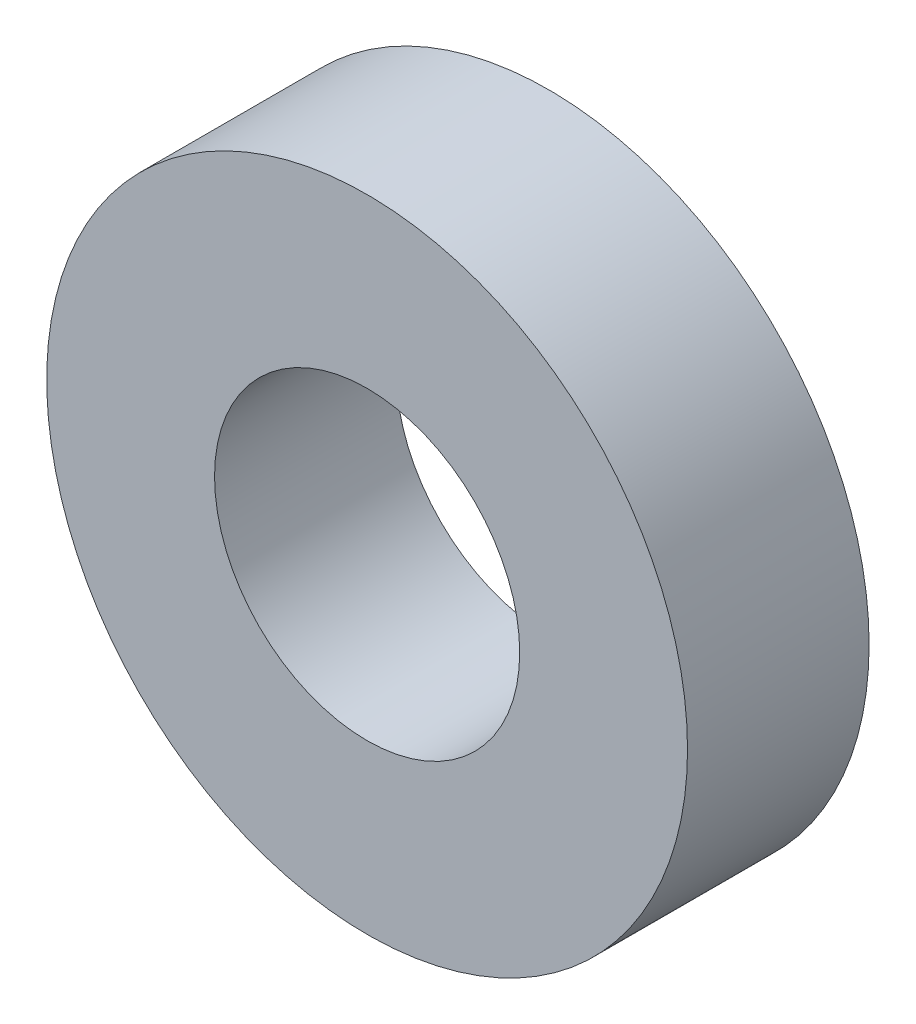
ISO-10303-21;
HEADER;
FILE_DESCRIPTION(('STEP AP214'),'2;1');
FILE_NAME('part.step','',(''),(''),'','','');
FILE_SCHEMA(('AUTOMOTIVE_DESIGN { 1 0 10303 214 1 1 1 1 }'));
ENDSEC;
DATA;
#1=APPLICATION_CONTEXT('core data for automotive mechanical design processes');
#2=APPLICATION_PROTOCOL_DEFINITION('international standard','automotive_design',2000,#1);
#3=PRODUCT_CONTEXT('',#1,'mechanical');
#4=PRODUCT('Part','Part','',(#3));
#5=PRODUCT_RELATED_PRODUCT_CATEGORY('part','',(#4));
#6=PRODUCT_DEFINITION_FORMATION('','',#4);
#7=PRODUCT_DEFINITION_CONTEXT('part definition',#1,'design');
#8=PRODUCT_DEFINITION('design','',#6,#7);
#9=PRODUCT_DEFINITION_SHAPE('','',#8);
#10=(LENGTH_UNIT() NAMED_UNIT(*) SI_UNIT(.MILLI.,.METRE.));
#11=(NAMED_UNIT(*) PLANE_ANGLE_UNIT() SI_UNIT($,.RADIAN.));
#12=(NAMED_UNIT(*) SI_UNIT($,.STERADIAN.) SOLID_ANGLE_UNIT());
#13=UNCERTAINTY_MEASURE_WITH_UNIT(LENGTH_MEASURE(1.E-05),#10,'distance_accuracy_value','');
#14=(GEOMETRIC_REPRESENTATION_CONTEXT(3) GLOBAL_UNCERTAINTY_ASSIGNED_CONTEXT((#13)) GLOBAL_UNIT_ASSIGNED_CONTEXT((#10,
#11,#12)) REPRESENTATION_CONTEXT('',''));
#15=CARTESIAN_POINT('',(0.,0.,0.));
#16=DIRECTION('',(0.,0.,1.));
#17=DIRECTION('',(1.,0.,0.));
#18=AXIS2_PLACEMENT_3D('',#15,#16,#17);
#19=CARTESIAN_POINT('',(0.,0.,11.9));
#20=DIRECTION('',(0.,0.,1.));
#21=DIRECTION('',(1.,0.,0.));
#22=AXIS2_PLACEMENT_3D('',#19,#20,#21);
#23=PLANE('',#22);
#24=CARTESIAN_POINT('',(0.,0.,11.9));
#25=DIRECTION('',(0.,0.,1.));
#26=DIRECTION('',(1.,0.,0.));
#27=AXIS2_PLACEMENT_3D('',#24,#25,#26);
#28=CIRCLE('',#27,21.);
#29=CARTESIAN_POINT('',(21.,0.,11.9));
#30=VERTEX_POINT('',#29);
#31=EDGE_CURVE('E10',#30,#30,#28,.T.);
#32=ORIENTED_EDGE('',*,*,#31,.T.);
#33=EDGE_LOOP('',(#32));
#34=FACE_BOUND('',#33,.T.);
#35=CARTESIAN_POINT('',(0.,0.,11.9));
#36=DIRECTION('',(0.,0.,1.));
#37=DIRECTION('',(1.,0.,0.));
#38=AXIS2_PLACEMENT_3D('',#35,#36,#37);
#39=CIRCLE('',#38,10.);
#40=CARTESIAN_POINT('',(10.,0.,11.9));
#41=VERTEX_POINT('',#40);
#42=EDGE_CURVE('E42',#41,#41,#39,.T.);
#43=ORIENTED_EDGE('',*,*,#42,.F.);
#44=EDGE_LOOP('',(#43));
#45=FACE_BOUND('',#44,.T.);
#46=ADVANCED_FACE('F31',(#34,#45),#23,.T.);
#47=CARTESIAN_POINT('',(0.,0.,0.));
#48=DIRECTION('',(0.,0.,1.));
#49=DIRECTION('',(1.,0.,0.));
#50=AXIS2_PLACEMENT_3D('',#47,#48,#49);
#51=PLANE('',#50);
#52=CARTESIAN_POINT('',(0.,0.,0.));
#53=DIRECTION('',(0.,0.,1.));
#54=DIRECTION('',(1.,0.,0.));
#55=AXIS2_PLACEMENT_3D('',#52,#53,#54);
#56=CIRCLE('',#55,21.);
#57=CARTESIAN_POINT('',(21.,0.,0.));
#58=VERTEX_POINT('',#57);
#59=EDGE_CURVE('E35',#58,#58,#56,.T.);
#60=ORIENTED_EDGE('',*,*,#59,.F.);
#61=EDGE_LOOP('',(#60));
#62=FACE_BOUND('',#61,.T.);
#63=CARTESIAN_POINT('',(0.,0.,0.));
#64=DIRECTION('',(0.,0.,1.));
#65=DIRECTION('',(1.,0.,0.));
#66=AXIS2_PLACEMENT_3D('',#63,#64,#65);
#67=CIRCLE('',#66,10.);
#68=CARTESIAN_POINT('',(10.,0.,0.));
#69=VERTEX_POINT('',#68);
#70=EDGE_CURVE('E44',#69,#69,#67,.T.);
#71=ORIENTED_EDGE('',*,*,#70,.T.);
#72=EDGE_LOOP('',(#71));
#73=FACE_BOUND('',#72,.T.);
#74=ADVANCED_FACE('F54',(#62,#73),#51,.F.);
#75=CARTESIAN_POINT('',(0.,0.,11.9));
#76=DIRECTION('',(0.,0.,-1.));
#77=DIRECTION('',(-1.,0.,0.));
#78=AXIS2_PLACEMENT_3D('',#75,#76,#77);
#79=CYLINDRICAL_SURFACE('',#78,21.);
#80=ORIENTED_EDGE('',*,*,#31,.F.);
#81=EDGE_LOOP('',(#80));
#82=FACE_BOUND('',#81,.T.);
#83=ORIENTED_EDGE('',*,*,#59,.T.);
#84=EDGE_LOOP('',(#83));
#85=FACE_BOUND('',#84,.T.);
#86=ADVANCED_FACE('F33',(#82,#85),#79,.T.);
#87=CARTESIAN_POINT('',(0.,0.,11.9));
#88=DIRECTION('',(0.,0.,-1.));
#89=DIRECTION('',(-1.,0.,0.));
#90=AXIS2_PLACEMENT_3D('',#87,#88,#89);
#91=CYLINDRICAL_SURFACE('',#90,10.);
#92=ORIENTED_EDGE('',*,*,#42,.T.);
#93=EDGE_LOOP('',(#92));
#94=FACE_BOUND('',#93,.T.);
#95=ORIENTED_EDGE('',*,*,#70,.F.);
#96=EDGE_LOOP('',(#95));
#97=FACE_BOUND('',#96,.T.);
#98=ADVANCED_FACE('F50',(#94,#97),#91,.F.);
#99=CLOSED_SHELL('',(#46,#74,#86,#98));
#100=MANIFOLD_SOLID_BREP('B2',#99);
#101=ADVANCED_BREP_SHAPE_REPRESENTATION('',(#18,#100),#14);
#102=SHAPE_DEFINITION_REPRESENTATION(#9,#101);
ENDSEC;
END-ISO-10303-21;
